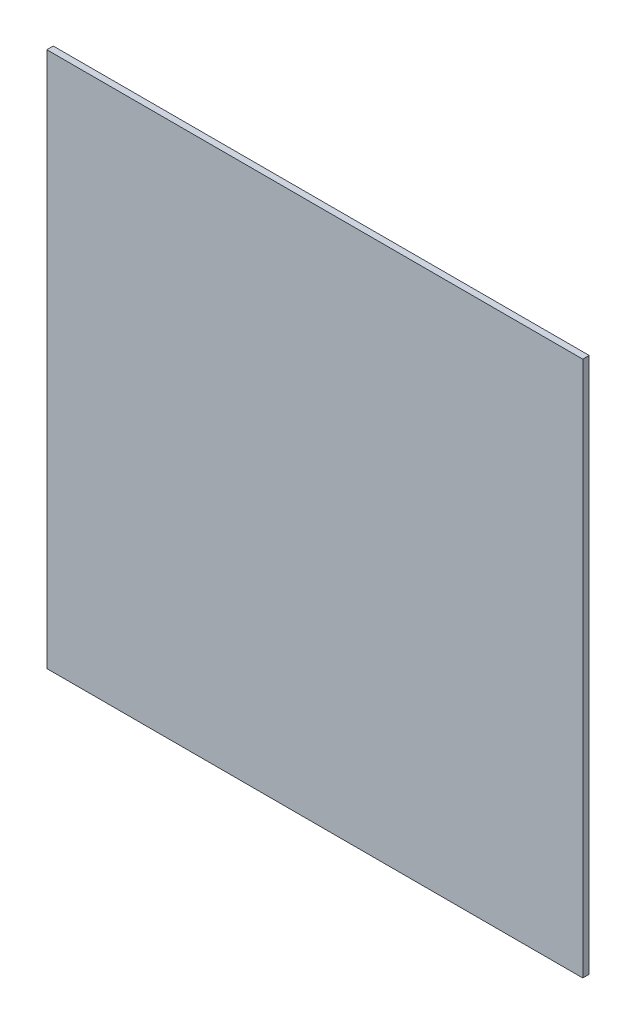
ISO-10303-21;
HEADER;
FILE_DESCRIPTION(('STEP AP214'),'2;1');
FILE_NAME('part.step','',(''),(''),'','','');
FILE_SCHEMA(('AUTOMOTIVE_DESIGN { 1 0 10303 214 1 1 1 1 }'));
ENDSEC;
DATA;
#1=APPLICATION_CONTEXT('core data for automotive mechanical design processes');
#2=APPLICATION_PROTOCOL_DEFINITION('international standard','automotive_design',2000,#1);
#3=PRODUCT_CONTEXT('',#1,'mechanical');
#4=PRODUCT('Part','Part','',(#3));
#5=PRODUCT_RELATED_PRODUCT_CATEGORY('part','',(#4));
#6=PRODUCT_DEFINITION_FORMATION('','',#4);
#7=PRODUCT_DEFINITION_CONTEXT('part definition',#1,'design');
#8=PRODUCT_DEFINITION('design','',#6,#7);
#9=PRODUCT_DEFINITION_SHAPE('','',#8);
#10=(LENGTH_UNIT() NAMED_UNIT(*) SI_UNIT(.MILLI.,.METRE.));
#11=(NAMED_UNIT(*) PLANE_ANGLE_UNIT() SI_UNIT($,.RADIAN.));
#12=(NAMED_UNIT(*) SI_UNIT($,.STERADIAN.) SOLID_ANGLE_UNIT());
#13=UNCERTAINTY_MEASURE_WITH_UNIT(LENGTH_MEASURE(1.E-05),#10,'distance_accuracy_value','');
#14=(GEOMETRIC_REPRESENTATION_CONTEXT(3) GLOBAL_UNCERTAINTY_ASSIGNED_CONTEXT((#13)) GLOBAL_UNIT_ASSIGNED_CONTEXT((#10,
#11,#12)) REPRESENTATION_CONTEXT('',''));
#15=CARTESIAN_POINT('',(0.,0.,0.));
#16=DIRECTION('',(0.,0.,1.));
#17=DIRECTION('',(1.,0.,0.));
#18=AXIS2_PLACEMENT_3D('',#15,#16,#17);
#19=CARTESIAN_POINT('',(0.,250.,0.));
#20=DIRECTION('',(1.,0.,0.));
#21=DIRECTION('',(0.,0.,-1.));
#22=AXIS2_PLACEMENT_3D('',#19,#20,#21);
#23=PLANE('',#22);
#24=DIRECTION('',(0.,0.,1.));
#25=VECTOR('',#24,1.);
#26=CARTESIAN_POINT('',(0.,0.,0.));
#27=LINE('',#26,#25);
#28=CARTESIAN_POINT('',(0.,0.,-3.));
#29=VERTEX_POINT('',#28);
#30=CARTESIAN_POINT('',(0.,0.,0.));
#31=VERTEX_POINT('',#30);
#32=EDGE_CURVE('E96',#29,#31,#27,.T.);
#33=ORIENTED_EDGE('',*,*,#32,.T.);
#34=DIRECTION('',(0.,-1.,0.));
#35=VECTOR('',#34,1.);
#36=CARTESIAN_POINT('',(0.,250.,0.));
#37=LINE('',#36,#35);
#38=CARTESIAN_POINT('',(0.,250.,0.));
#39=VERTEX_POINT('',#38);
#40=EDGE_CURVE('E11',#39,#31,#37,.T.);
#41=ORIENTED_EDGE('',*,*,#40,.F.);
#42=DIRECTION('',(0.,0.,1.));
#43=VECTOR('',#42,1.);
#44=CARTESIAN_POINT('',(0.,250.,0.));
#45=LINE('',#44,#43);
#46=CARTESIAN_POINT('',(0.,250.,-3.));
#47=VERTEX_POINT('',#46);
#48=EDGE_CURVE('E84',#47,#39,#45,.T.);
#49=ORIENTED_EDGE('',*,*,#48,.F.);
#50=DIRECTION('',(0.,-1.,0.));
#51=VECTOR('',#50,1.);
#52=CARTESIAN_POINT('',(0.,250.,-3.));
#53=LINE('',#52,#51);
#54=EDGE_CURVE('E92',#47,#29,#53,.T.);
#55=ORIENTED_EDGE('',*,*,#54,.T.);
#56=EDGE_LOOP('',(#33,#41,#49,#55));
#57=FACE_BOUND('',#56,.T.);
#58=ADVANCED_FACE('F33',(#57),#23,.F.);
#59=CARTESIAN_POINT('',(0.,250.,0.));
#60=DIRECTION('',(0.,0.,-1.));
#61=DIRECTION('',(-1.,0.,0.));
#62=AXIS2_PLACEMENT_3D('',#59,#60,#61);
#63=PLANE('',#62);
#64=DIRECTION('',(1.,0.,0.));
#65=VECTOR('',#64,1.);
#66=CARTESIAN_POINT('',(0.,0.,0.));
#67=LINE('',#66,#65);
#68=CARTESIAN_POINT('',(250.,0.,0.));
#69=VERTEX_POINT('',#68);
#70=EDGE_CURVE('E88',#31,#69,#67,.T.);
#71=ORIENTED_EDGE('',*,*,#70,.T.);
#72=DIRECTION('',(0.,-1.,0.));
#73=VECTOR('',#72,1.);
#74=CARTESIAN_POINT('',(250.,250.,0.));
#75=LINE('',#74,#73);
#76=CARTESIAN_POINT('',(250.,250.,0.));
#77=VERTEX_POINT('',#76);
#78=EDGE_CURVE('E41',#77,#69,#75,.T.);
#79=ORIENTED_EDGE('',*,*,#78,.F.);
#80=DIRECTION('',(1.,0.,0.));
#81=VECTOR('',#80,1.);
#82=CARTESIAN_POINT('',(0.,250.,0.));
#83=LINE('',#82,#81);
#84=EDGE_CURVE('E79',#39,#77,#83,.T.);
#85=ORIENTED_EDGE('',*,*,#84,.F.);
#86=ORIENTED_EDGE('',*,*,#40,.T.);
#87=EDGE_LOOP('',(#71,#79,#85,#86));
#88=FACE_BOUND('',#87,.T.);
#89=ADVANCED_FACE('F87',(#88),#63,.F.);
#90=CARTESIAN_POINT('',(250.,250.,0.));
#91=DIRECTION('',(-1.,0.,0.));
#92=DIRECTION('',(0.,0.,1.));
#93=AXIS2_PLACEMENT_3D('',#90,#91,#92);
#94=PLANE('',#93);
#95=DIRECTION('',(0.,0.,-1.));
#96=VECTOR('',#95,1.);
#97=CARTESIAN_POINT('',(250.,0.,0.));
#98=LINE('',#97,#96);
#99=CARTESIAN_POINT('',(250.,0.,-3.));
#100=VERTEX_POINT('',#99);
#101=EDGE_CURVE('E66',#69,#100,#98,.T.);
#102=ORIENTED_EDGE('',*,*,#101,.T.);
#103=DIRECTION('',(0.,-1.,0.));
#104=VECTOR('',#103,1.);
#105=CARTESIAN_POINT('',(250.,250.,-3.));
#106=LINE('',#105,#104);
#107=CARTESIAN_POINT('',(250.,250.,-3.));
#108=VERTEX_POINT('',#107);
#109=EDGE_CURVE('E89',#108,#100,#106,.T.);
#110=ORIENTED_EDGE('',*,*,#109,.F.);
#111=DIRECTION('',(0.,0.,-1.));
#112=VECTOR('',#111,1.);
#113=CARTESIAN_POINT('',(250.,250.,0.));
#114=LINE('',#113,#112);
#115=EDGE_CURVE('E82',#77,#108,#114,.T.);
#116=ORIENTED_EDGE('',*,*,#115,.F.);
#117=ORIENTED_EDGE('',*,*,#78,.T.);
#118=EDGE_LOOP('',(#102,#110,#116,#117));
#119=FACE_BOUND('',#118,.T.);
#120=ADVANCED_FACE('F90',(#119),#94,.F.);
#121=CARTESIAN_POINT('',(0.,250.,-3.));
#122=DIRECTION('',(0.,0.,1.));
#123=DIRECTION('',(1.,0.,0.));
#124=AXIS2_PLACEMENT_3D('',#121,#122,#123);
#125=PLANE('',#124);
#126=DIRECTION('',(-1.,0.,0.));
#127=VECTOR('',#126,1.);
#128=CARTESIAN_POINT('',(0.,0.,-3.));
#129=LINE('',#128,#127);
#130=EDGE_CURVE('E72',#100,#29,#129,.T.);
#131=ORIENTED_EDGE('',*,*,#130,.T.);
#132=ORIENTED_EDGE('',*,*,#54,.F.);
#133=DIRECTION('',(-1.,0.,0.));
#134=VECTOR('',#133,1.);
#135=CARTESIAN_POINT('',(0.,250.,-3.));
#136=LINE('',#135,#134);
#137=EDGE_CURVE('E49',#108,#47,#136,.T.);
#138=ORIENTED_EDGE('',*,*,#137,.F.);
#139=ORIENTED_EDGE('',*,*,#109,.T.);
#140=EDGE_LOOP('',(#131,#132,#138,#139));
#141=FACE_BOUND('',#140,.T.);
#142=ADVANCED_FACE('F103',(#141),#125,.F.);
#143=CARTESIAN_POINT('',(0.,250.,0.));
#144=DIRECTION('',(0.,-1.,0.));
#145=DIRECTION('',(0.,0.,-1.));
#146=AXIS2_PLACEMENT_3D('',#143,#144,#145);
#147=PLANE('',#146);
#148=ORIENTED_EDGE('',*,*,#48,.T.);
#149=ORIENTED_EDGE('',*,*,#84,.T.);
#150=ORIENTED_EDGE('',*,*,#115,.T.);
#151=ORIENTED_EDGE('',*,*,#137,.T.);
#152=EDGE_LOOP('',(#148,#149,#150,#151));
#153=FACE_BOUND('',#152,.T.);
#154=ADVANCED_FACE('F80',(#153),#147,.F.);
#155=CARTESIAN_POINT('',(0.,0.,0.));
#156=DIRECTION('',(0.,-1.,0.));
#157=DIRECTION('',(0.,0.,-1.));
#158=AXIS2_PLACEMENT_3D('',#155,#156,#157);
#159=PLANE('',#158);
#160=ORIENTED_EDGE('',*,*,#32,.F.);
#161=ORIENTED_EDGE('',*,*,#130,.F.);
#162=ORIENTED_EDGE('',*,*,#101,.F.);
#163=ORIENTED_EDGE('',*,*,#70,.F.);
#164=EDGE_LOOP('',(#160,#161,#162,#163));
#165=FACE_BOUND('',#164,.T.);
#166=ADVANCED_FACE('F106',(#165),#159,.T.);
#167=CLOSED_SHELL('',(#58,#89,#120,#142,#154,#166));
#168=MANIFOLD_SOLID_BREP('B2',#167);
#169=ADVANCED_BREP_SHAPE_REPRESENTATION('',(#18,#168),#14);
#170=SHAPE_DEFINITION_REPRESENTATION(#9,#169);
ENDSEC;
END-ISO-10303-21;
